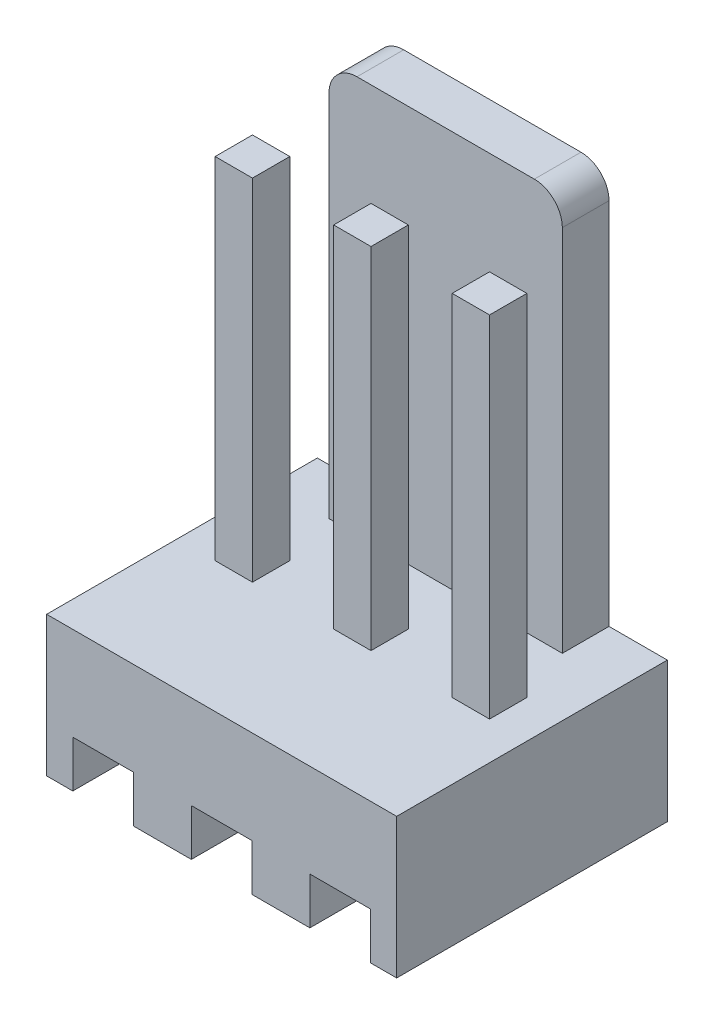
ISO-10303-21;
HEADER;
FILE_DESCRIPTION(('STEP AP214'),'2;1');
FILE_NAME('part.step','',(''),(''),'','','');
FILE_SCHEMA(('AUTOMOTIVE_DESIGN { 1 0 10303 214 1 1 1 1 }'));
ENDSEC;
DATA;
#1=APPLICATION_CONTEXT('core data for automotive mechanical design processes');
#2=APPLICATION_PROTOCOL_DEFINITION('international standard','automotive_design',2000,#1);
#3=PRODUCT_CONTEXT('',#1,'mechanical');
#4=PRODUCT('Part','Part','',(#3));
#5=PRODUCT_RELATED_PRODUCT_CATEGORY('part','',(#4));
#6=PRODUCT_DEFINITION_FORMATION('','',#4);
#7=PRODUCT_DEFINITION_CONTEXT('part definition',#1,'design');
#8=PRODUCT_DEFINITION('design','',#6,#7);
#9=PRODUCT_DEFINITION_SHAPE('','',#8);
#10=(LENGTH_UNIT() NAMED_UNIT(*) SI_UNIT(.MILLI.,.METRE.));
#11=(NAMED_UNIT(*) PLANE_ANGLE_UNIT() SI_UNIT($,.RADIAN.));
#12=(NAMED_UNIT(*) SI_UNIT($,.STERADIAN.) SOLID_ANGLE_UNIT());
#13=UNCERTAINTY_MEASURE_WITH_UNIT(LENGTH_MEASURE(1.E-05),#10,'distance_accuracy_value','');
#14=(GEOMETRIC_REPRESENTATION_CONTEXT(3) GLOBAL_UNCERTAINTY_ASSIGNED_CONTEXT((#13)) GLOBAL_UNIT_ASSIGNED_CONTEXT((#10,
#11,#12)) REPRESENTATION_CONTEXT('',''));
#15=CARTESIAN_POINT('',(0.,0.,0.));
#16=DIRECTION('',(0.,0.,1.));
#17=DIRECTION('',(1.,0.,0.));
#18=AXIS2_PLACEMENT_3D('',#15,#16,#17);
#19=CARTESIAN_POINT('',(5.89,10.5,-3.6));
#20=DIRECTION('',(1.,0.,0.));
#21=DIRECTION('',(0.,0.,-1.));
#22=AXIS2_PLACEMENT_3D('',#19,#20,#21);
#23=PLANE('',#22);
#24=DIRECTION('',(0.,0.,1.));
#25=VECTOR('',#24,1.);
#26=CARTESIAN_POINT('',(5.89,3.,-3.6));
#27=LINE('',#26,#25);
#28=CARTESIAN_POINT('',(5.89,3.,-3.6));
#29=VERTEX_POINT('',#28);
#30=CARTESIAN_POINT('',(5.89,3.,-2.8));
#31=VERTEX_POINT('',#30);
#32=EDGE_CURVE('E111',#29,#31,#27,.T.);
#33=ORIENTED_EDGE('',*,*,#32,.T.);
#34=DIRECTION('',(0.,-1.,0.));
#35=VECTOR('',#34,1.);
#36=CARTESIAN_POINT('',(5.89,10.5,-2.8));
#37=LINE('',#36,#35);
#38=CARTESIAN_POINT('',(5.89,10.5,-2.8));
#39=VERTEX_POINT('',#38);
#40=EDGE_CURVE('E12',#39,#31,#37,.T.);
#41=ORIENTED_EDGE('',*,*,#40,.F.);
#42=DIRECTION('',(0.,0.,1.));
#43=VECTOR('',#42,1.);
#44=CARTESIAN_POINT('',(5.89,10.5,-3.6));
#45=LINE('',#44,#43);
#46=CARTESIAN_POINT('',(5.89,10.5,-3.6));
#47=VERTEX_POINT('',#46);
#48=EDGE_CURVE('E99',#47,#39,#45,.T.);
#49=ORIENTED_EDGE('',*,*,#48,.F.);
#50=DIRECTION('',(0.,-1.,0.));
#51=VECTOR('',#50,1.);
#52=CARTESIAN_POINT('',(5.89,10.5,-3.6));
#53=LINE('',#52,#51);
#54=EDGE_CURVE('E107',#47,#29,#53,.T.);
#55=ORIENTED_EDGE('',*,*,#54,.T.);
#56=EDGE_LOOP('',(#33,#41,#49,#55));
#57=FACE_BOUND('',#56,.T.);
#58=ADVANCED_FACE('F48',(#57),#23,.F.);
#59=CARTESIAN_POINT('',(5.89,10.5,-2.8));
#60=DIRECTION('',(0.,0.,-1.));
#61=DIRECTION('',(-1.,0.,0.));
#62=AXIS2_PLACEMENT_3D('',#59,#60,#61);
#63=PLANE('',#62);
#64=DIRECTION('',(1.,0.,0.));
#65=VECTOR('',#64,1.);
#66=CARTESIAN_POINT('',(5.89,3.,-2.8));
#67=LINE('',#66,#65);
#68=CARTESIAN_POINT('',(6.69,3.,-2.8));
#69=VERTEX_POINT('',#68);
#70=EDGE_CURVE('E103',#31,#69,#67,.T.);
#71=ORIENTED_EDGE('',*,*,#70,.T.);
#72=DIRECTION('',(0.,-1.,0.));
#73=VECTOR('',#72,1.);
#74=CARTESIAN_POINT('',(6.69,10.5,-2.8));
#75=LINE('',#74,#73);
#76=CARTESIAN_POINT('',(6.69,10.5,-2.8));
#77=VERTEX_POINT('',#76);
#78=EDGE_CURVE('E56',#77,#69,#75,.T.);
#79=ORIENTED_EDGE('',*,*,#78,.F.);
#80=DIRECTION('',(1.,0.,0.));
#81=VECTOR('',#80,1.);
#82=CARTESIAN_POINT('',(5.89,10.5,-2.8));
#83=LINE('',#82,#81);
#84=EDGE_CURVE('E94',#39,#77,#83,.T.);
#85=ORIENTED_EDGE('',*,*,#84,.F.);
#86=ORIENTED_EDGE('',*,*,#40,.T.);
#87=EDGE_LOOP('',(#71,#79,#85,#86));
#88=FACE_BOUND('',#87,.T.);
#89=ADVANCED_FACE('F102',(#88),#63,.F.);
#90=CARTESIAN_POINT('',(6.69,10.5,-3.6));
#91=DIRECTION('',(-1.,0.,0.));
#92=DIRECTION('',(0.,0.,1.));
#93=AXIS2_PLACEMENT_3D('',#90,#91,#92);
#94=PLANE('',#93);
#95=DIRECTION('',(0.,0.,-1.));
#96=VECTOR('',#95,1.);
#97=CARTESIAN_POINT('',(6.69,3.,-3.6));
#98=LINE('',#97,#96);
#99=CARTESIAN_POINT('',(6.69,3.,-3.6));
#100=VERTEX_POINT('',#99);
#101=EDGE_CURVE('E81',#69,#100,#98,.T.);
#102=ORIENTED_EDGE('',*,*,#101,.T.);
#103=DIRECTION('',(0.,-1.,0.));
#104=VECTOR('',#103,1.);
#105=CARTESIAN_POINT('',(6.69,10.5,-3.6));
#106=LINE('',#105,#104);
#107=CARTESIAN_POINT('',(6.69,10.5,-3.6));
#108=VERTEX_POINT('',#107);
#109=EDGE_CURVE('E104',#108,#100,#106,.T.);
#110=ORIENTED_EDGE('',*,*,#109,.F.);
#111=DIRECTION('',(0.,0.,-1.));
#112=VECTOR('',#111,1.);
#113=CARTESIAN_POINT('',(6.69,10.5,-3.6));
#114=LINE('',#113,#112);
#115=EDGE_CURVE('E97',#77,#108,#114,.T.);
#116=ORIENTED_EDGE('',*,*,#115,.F.);
#117=ORIENTED_EDGE('',*,*,#78,.T.);
#118=EDGE_LOOP('',(#102,#110,#116,#117));
#119=FACE_BOUND('',#118,.T.);
#120=ADVANCED_FACE('F105',(#119),#94,.F.);
#121=CARTESIAN_POINT('',(5.89,10.5,-3.6));
#122=DIRECTION('',(0.,0.,1.));
#123=DIRECTION('',(1.,0.,0.));
#124=AXIS2_PLACEMENT_3D('',#121,#122,#123);
#125=PLANE('',#124);
#126=DIRECTION('',(-1.,0.,0.));
#127=VECTOR('',#126,1.);
#128=CARTESIAN_POINT('',(5.89,3.,-3.6));
#129=LINE('',#128,#127);
#130=EDGE_CURVE('E87',#100,#29,#129,.T.);
#131=ORIENTED_EDGE('',*,*,#130,.T.);
#132=ORIENTED_EDGE('',*,*,#54,.F.);
#133=DIRECTION('',(-1.,0.,0.));
#134=VECTOR('',#133,1.);
#135=CARTESIAN_POINT('',(5.89,10.5,-3.6));
#136=LINE('',#135,#134);
#137=EDGE_CURVE('E64',#108,#47,#136,.T.);
#138=ORIENTED_EDGE('',*,*,#137,.F.);
#139=ORIENTED_EDGE('',*,*,#109,.T.);
#140=EDGE_LOOP('',(#131,#132,#138,#139));
#141=FACE_BOUND('',#140,.T.);
#142=ADVANCED_FACE('F118',(#141),#125,.F.);
#143=CARTESIAN_POINT('',(5.89,10.5,-2.8));
#144=DIRECTION('',(0.,1.,0.));
#145=DIRECTION('',(0.,0.,1.));
#146=AXIS2_PLACEMENT_3D('',#143,#144,#145);
#147=PLANE('',#146);
#148=ORIENTED_EDGE('',*,*,#48,.T.);
#149=ORIENTED_EDGE('',*,*,#84,.T.);
#150=ORIENTED_EDGE('',*,*,#115,.T.);
#151=ORIENTED_EDGE('',*,*,#137,.T.);
#152=EDGE_LOOP('',(#148,#149,#150,#151));
#153=FACE_BOUND('',#152,.T.);
#154=ADVANCED_FACE('F95',(#153),#147,.T.);
#155=CARTESIAN_POINT('',(5.89,3.,-2.8));
#156=DIRECTION('',(0.,1.,0.));
#157=DIRECTION('',(0.,0.,1.));
#158=AXIS2_PLACEMENT_3D('',#155,#156,#157);
#159=PLANE('',#158);
#160=ORIENTED_EDGE('',*,*,#32,.F.);
#161=ORIENTED_EDGE('',*,*,#130,.F.);
#162=ORIENTED_EDGE('',*,*,#101,.F.);
#163=ORIENTED_EDGE('',*,*,#70,.F.);
#164=EDGE_LOOP('',(#160,#161,#162,#163));
#165=FACE_BOUND('',#164,.T.);
#166=ADVANCED_FACE('F121',(#165),#159,.F.);
#167=CLOSED_SHELL('',(#58,#89,#120,#142,#154,#166));
#168=MANIFOLD_SOLID_BREP('B2',#167);
#169=CARTESIAN_POINT('',(1.61,10.5,-3.6));
#170=DIRECTION('',(0.,0.,1.));
#171=DIRECTION('',(1.,0.,0.));
#172=AXIS2_PLACEMENT_3D('',#169,#170,#171);
#173=PLANE('',#172);
#174=DIRECTION('',(-1.,0.,0.));
#175=VECTOR('',#174,1.);
#176=CARTESIAN_POINT('',(1.61,3.,-3.6));
#177=LINE('',#176,#175);
#178=CARTESIAN_POINT('',(1.61,3.,-3.6));
#179=VERTEX_POINT('',#178);
#180=CARTESIAN_POINT('',(0.810000000000001,3.,-3.6));
#181=VERTEX_POINT('',#180);
#182=EDGE_CURVE('E245',#179,#181,#177,.T.);
#183=ORIENTED_EDGE('',*,*,#182,.T.);
#184=DIRECTION('',(0.,-1.,0.));
#185=VECTOR('',#184,1.);
#186=CARTESIAN_POINT('',(0.810000000000001,10.5,-3.6));
#187=LINE('',#186,#185);
#188=CARTESIAN_POINT('',(0.810000000000001,10.5,-3.6));
#189=VERTEX_POINT('',#188);
#190=EDGE_CURVE('E46',#189,#181,#187,.T.);
#191=ORIENTED_EDGE('',*,*,#190,.F.);
#192=DIRECTION('',(-1.,0.,0.));
#193=VECTOR('',#192,1.);
#194=CARTESIAN_POINT('',(1.61,10.5,-3.6));
#195=LINE('',#194,#193);
#196=CARTESIAN_POINT('',(1.61,10.5,-3.6));
#197=VERTEX_POINT('',#196);
#198=EDGE_CURVE('E233',#197,#189,#195,.T.);
#199=ORIENTED_EDGE('',*,*,#198,.F.);
#200=DIRECTION('',(0.,-1.,0.));
#201=VECTOR('',#200,1.);
#202=CARTESIAN_POINT('',(1.61,10.5,-3.6));
#203=LINE('',#202,#201);
#204=EDGE_CURVE('E241',#197,#179,#203,.T.);
#205=ORIENTED_EDGE('',*,*,#204,.T.);
#206=EDGE_LOOP('',(#183,#191,#199,#205));
#207=FACE_BOUND('',#206,.T.);
#208=ADVANCED_FACE('F182',(#207),#173,.F.);
#209=CARTESIAN_POINT('',(0.810000000000001,10.5,-3.6));
#210=DIRECTION('',(1.,0.,0.));
#211=DIRECTION('',(0.,0.,-1.));
#212=AXIS2_PLACEMENT_3D('',#209,#210,#211);
#213=PLANE('',#212);
#214=DIRECTION('',(0.,0.,1.));
#215=VECTOR('',#214,1.);
#216=CARTESIAN_POINT('',(0.810000000000001,3.,-3.6));
#217=LINE('',#216,#215);
#218=CARTESIAN_POINT('',(0.810000000000001,3.,-2.8));
#219=VERTEX_POINT('',#218);
#220=EDGE_CURVE('E237',#181,#219,#217,.T.);
#221=ORIENTED_EDGE('',*,*,#220,.T.);
#222=DIRECTION('',(0.,-1.,0.));
#223=VECTOR('',#222,1.);
#224=CARTESIAN_POINT('',(0.810000000000001,10.5,-2.8));
#225=LINE('',#224,#223);
#226=CARTESIAN_POINT('',(0.810000000000001,10.5,-2.8));
#227=VERTEX_POINT('',#226);
#228=EDGE_CURVE('E190',#227,#219,#225,.T.);
#229=ORIENTED_EDGE('',*,*,#228,.F.);
#230=DIRECTION('',(0.,0.,1.));
#231=VECTOR('',#230,1.);
#232=CARTESIAN_POINT('',(0.810000000000001,10.5,-3.6));
#233=LINE('',#232,#231);
#234=EDGE_CURVE('E228',#189,#227,#233,.T.);
#235=ORIENTED_EDGE('',*,*,#234,.F.);
#236=ORIENTED_EDGE('',*,*,#190,.T.);
#237=EDGE_LOOP('',(#221,#229,#235,#236));
#238=FACE_BOUND('',#237,.T.);
#239=ADVANCED_FACE('F236',(#238),#213,.F.);
#240=CARTESIAN_POINT('',(1.61,10.5,-2.8));
#241=DIRECTION('',(0.,0.,-1.));
#242=DIRECTION('',(-1.,0.,0.));
#243=AXIS2_PLACEMENT_3D('',#240,#241,#242);
#244=PLANE('',#243);
#245=DIRECTION('',(1.,0.,0.));
#246=VECTOR('',#245,1.);
#247=CARTESIAN_POINT('',(1.61,3.,-2.8));
#248=LINE('',#247,#246);
#249=CARTESIAN_POINT('',(1.61,3.,-2.8));
#250=VERTEX_POINT('',#249);
#251=EDGE_CURVE('E215',#219,#250,#248,.T.);
#252=ORIENTED_EDGE('',*,*,#251,.T.);
#253=DIRECTION('',(0.,-1.,0.));
#254=VECTOR('',#253,1.);
#255=CARTESIAN_POINT('',(1.61,10.5,-2.8));
#256=LINE('',#255,#254);
#257=CARTESIAN_POINT('',(1.61,10.5,-2.8));
#258=VERTEX_POINT('',#257);
#259=EDGE_CURVE('E238',#258,#250,#256,.T.);
#260=ORIENTED_EDGE('',*,*,#259,.F.);
#261=DIRECTION('',(1.,0.,0.));
#262=VECTOR('',#261,1.);
#263=CARTESIAN_POINT('',(1.61,10.5,-2.8));
#264=LINE('',#263,#262);
#265=EDGE_CURVE('E231',#227,#258,#264,.T.);
#266=ORIENTED_EDGE('',*,*,#265,.F.);
#267=ORIENTED_EDGE('',*,*,#228,.T.);
#268=EDGE_LOOP('',(#252,#260,#266,#267));
#269=FACE_BOUND('',#268,.T.);
#270=ADVANCED_FACE('F239',(#269),#244,.F.);
#271=CARTESIAN_POINT('',(1.61,10.5,-3.6));
#272=DIRECTION('',(-1.,0.,0.));
#273=DIRECTION('',(0.,0.,1.));
#274=AXIS2_PLACEMENT_3D('',#271,#272,#273);
#275=PLANE('',#274);
#276=DIRECTION('',(0.,0.,-1.));
#277=VECTOR('',#276,1.);
#278=CARTESIAN_POINT('',(1.61,3.,-3.6));
#279=LINE('',#278,#277);
#280=EDGE_CURVE('E221',#250,#179,#279,.T.);
#281=ORIENTED_EDGE('',*,*,#280,.T.);
#282=ORIENTED_EDGE('',*,*,#204,.F.);
#283=DIRECTION('',(0.,0.,-1.));
#284=VECTOR('',#283,1.);
#285=CARTESIAN_POINT('',(1.61,10.5,-3.6));
#286=LINE('',#285,#284);
#287=EDGE_CURVE('E198',#258,#197,#286,.T.);
#288=ORIENTED_EDGE('',*,*,#287,.F.);
#289=ORIENTED_EDGE('',*,*,#259,.T.);
#290=EDGE_LOOP('',(#281,#282,#288,#289));
#291=FACE_BOUND('',#290,.T.);
#292=ADVANCED_FACE('F252',(#291),#275,.F.);
#293=CARTESIAN_POINT('',(0.810000000000001,10.5,-3.6));
#294=DIRECTION('',(0.,1.,0.));
#295=DIRECTION('',(0.,0.,1.));
#296=AXIS2_PLACEMENT_3D('',#293,#294,#295);
#297=PLANE('',#296);
#298=ORIENTED_EDGE('',*,*,#198,.T.);
#299=ORIENTED_EDGE('',*,*,#234,.T.);
#300=ORIENTED_EDGE('',*,*,#265,.T.);
#301=ORIENTED_EDGE('',*,*,#287,.T.);
#302=EDGE_LOOP('',(#298,#299,#300,#301));
#303=FACE_BOUND('',#302,.T.);
#304=ADVANCED_FACE('F229',(#303),#297,.T.);
#305=CARTESIAN_POINT('',(0.810000000000001,3.,-3.6));
#306=DIRECTION('',(0.,1.,0.));
#307=DIRECTION('',(0.,0.,1.));
#308=AXIS2_PLACEMENT_3D('',#305,#306,#307);
#309=PLANE('',#308);
#310=ORIENTED_EDGE('',*,*,#182,.F.);
#311=ORIENTED_EDGE('',*,*,#280,.F.);
#312=ORIENTED_EDGE('',*,*,#251,.F.);
#313=ORIENTED_EDGE('',*,*,#220,.F.);
#314=EDGE_LOOP('',(#310,#311,#312,#313));
#315=FACE_BOUND('',#314,.T.);
#316=ADVANCED_FACE('F255',(#315),#309,.F.);
#317=CLOSED_SHELL('',(#208,#239,#270,#292,#304,#316));
#318=MANIFOLD_SOLID_BREP('B6',#317);
#319=CARTESIAN_POINT('',(3.35,10.5,-3.6));
#320=DIRECTION('',(1.,0.,0.));
#321=DIRECTION('',(0.,0.,-1.));
#322=AXIS2_PLACEMENT_3D('',#319,#320,#321);
#323=PLANE('',#322);
#324=DIRECTION('',(0.,0.,1.));
#325=VECTOR('',#324,1.);
#326=CARTESIAN_POINT('',(3.35,3.,-3.6));
#327=LINE('',#326,#325);
#328=CARTESIAN_POINT('',(3.35,3.,-3.6));
#329=VERTEX_POINT('',#328);
#330=CARTESIAN_POINT('',(3.35,3.,-2.8));
#331=VERTEX_POINT('',#330);
#332=EDGE_CURVE('E378',#329,#331,#327,.T.);
#333=ORIENTED_EDGE('',*,*,#332,.T.);
#334=DIRECTION('',(0.,-1.,0.));
#335=VECTOR('',#334,1.);
#336=CARTESIAN_POINT('',(3.35,10.5,-2.8));
#337=LINE('',#336,#335);
#338=CARTESIAN_POINT('',(3.35,10.5,-2.8));
#339=VERTEX_POINT('',#338);
#340=EDGE_CURVE('E180',#339,#331,#337,.T.);
#341=ORIENTED_EDGE('',*,*,#340,.F.);
#342=DIRECTION('',(0.,0.,1.));
#343=VECTOR('',#342,1.);
#344=CARTESIAN_POINT('',(3.35,10.5,-3.6));
#345=LINE('',#344,#343);
#346=CARTESIAN_POINT('',(3.35,10.5,-3.6));
#347=VERTEX_POINT('',#346);
#348=EDGE_CURVE('E366',#347,#339,#345,.T.);
#349=ORIENTED_EDGE('',*,*,#348,.F.);
#350=DIRECTION('',(0.,-1.,0.));
#351=VECTOR('',#350,1.);
#352=CARTESIAN_POINT('',(3.35,10.5,-3.6));
#353=LINE('',#352,#351);
#354=EDGE_CURVE('E374',#347,#329,#353,.T.);
#355=ORIENTED_EDGE('',*,*,#354,.T.);
#356=EDGE_LOOP('',(#333,#341,#349,#355));
#357=FACE_BOUND('',#356,.T.);
#358=ADVANCED_FACE('F315',(#357),#323,.F.);
#359=CARTESIAN_POINT('',(3.35,10.5,-2.8));
#360=DIRECTION('',(0.,0.,-1.));
#361=DIRECTION('',(-1.,0.,0.));
#362=AXIS2_PLACEMENT_3D('',#359,#360,#361);
#363=PLANE('',#362);
#364=DIRECTION('',(1.,0.,0.));
#365=VECTOR('',#364,1.);
#366=CARTESIAN_POINT('',(3.35,3.,-2.8));
#367=LINE('',#366,#365);
#368=CARTESIAN_POINT('',(4.15,3.,-2.8));
#369=VERTEX_POINT('',#368);
#370=EDGE_CURVE('E370',#331,#369,#367,.T.);
#371=ORIENTED_EDGE('',*,*,#370,.T.);
#372=DIRECTION('',(0.,-1.,0.));
#373=VECTOR('',#372,1.);
#374=CARTESIAN_POINT('',(4.15,10.5,-2.8));
#375=LINE('',#374,#373);
#376=CARTESIAN_POINT('',(4.15,10.5,-2.8));
#377=VERTEX_POINT('',#376);
#378=EDGE_CURVE('E323',#377,#369,#375,.T.);
#379=ORIENTED_EDGE('',*,*,#378,.F.);
#380=DIRECTION('',(1.,0.,0.));
#381=VECTOR('',#380,1.);
#382=CARTESIAN_POINT('',(3.35,10.5,-2.8));
#383=LINE('',#382,#381);
#384=EDGE_CURVE('E361',#339,#377,#383,.T.);
#385=ORIENTED_EDGE('',*,*,#384,.F.);
#386=ORIENTED_EDGE('',*,*,#340,.T.);
#387=EDGE_LOOP('',(#371,#379,#385,#386));
#388=FACE_BOUND('',#387,.T.);
#389=ADVANCED_FACE('F369',(#388),#363,.F.);
#390=CARTESIAN_POINT('',(4.15,10.5,-3.6));
#391=DIRECTION('',(-1.,0.,0.));
#392=DIRECTION('',(0.,0.,1.));
#393=AXIS2_PLACEMENT_3D('',#390,#391,#392);
#394=PLANE('',#393);
#395=DIRECTION('',(0.,0.,-1.));
#396=VECTOR('',#395,1.);
#397=CARTESIAN_POINT('',(4.15,3.,-3.6));
#398=LINE('',#397,#396);
#399=CARTESIAN_POINT('',(4.15,3.,-3.6));
#400=VERTEX_POINT('',#399);
#401=EDGE_CURVE('E348',#369,#400,#398,.T.);
#402=ORIENTED_EDGE('',*,*,#401,.T.);
#403=DIRECTION('',(0.,-1.,0.));
#404=VECTOR('',#403,1.);
#405=CARTESIAN_POINT('',(4.15,10.5,-3.6));
#406=LINE('',#405,#404);
#407=CARTESIAN_POINT('',(4.15,10.5,-3.6));
#408=VERTEX_POINT('',#407);
#409=EDGE_CURVE('E371',#408,#400,#406,.T.);
#410=ORIENTED_EDGE('',*,*,#409,.F.);
#411=DIRECTION('',(0.,0.,-1.));
#412=VECTOR('',#411,1.);
#413=CARTESIAN_POINT('',(4.15,10.5,-3.6));
#414=LINE('',#413,#412);
#415=EDGE_CURVE('E364',#377,#408,#414,.T.);
#416=ORIENTED_EDGE('',*,*,#415,.F.);
#417=ORIENTED_EDGE('',*,*,#378,.T.);
#418=EDGE_LOOP('',(#402,#410,#416,#417));
#419=FACE_BOUND('',#418,.T.);
#420=ADVANCED_FACE('F372',(#419),#394,.F.);
#421=CARTESIAN_POINT('',(3.35,10.5,-3.6));
#422=DIRECTION('',(0.,0.,1.));
#423=DIRECTION('',(1.,0.,0.));
#424=AXIS2_PLACEMENT_3D('',#421,#422,#423);
#425=PLANE('',#424);
#426=DIRECTION('',(-1.,0.,0.));
#427=VECTOR('',#426,1.);
#428=CARTESIAN_POINT('',(3.35,3.,-3.6));
#429=LINE('',#428,#427);
#430=EDGE_CURVE('E354',#400,#329,#429,.T.);
#431=ORIENTED_EDGE('',*,*,#430,.T.);
#432=ORIENTED_EDGE('',*,*,#354,.F.);
#433=DIRECTION('',(-1.,0.,0.));
#434=VECTOR('',#433,1.);
#435=CARTESIAN_POINT('',(3.35,10.5,-3.6));
#436=LINE('',#435,#434);
#437=EDGE_CURVE('E331',#408,#347,#436,.T.);
#438=ORIENTED_EDGE('',*,*,#437,.F.);
#439=ORIENTED_EDGE('',*,*,#409,.T.);
#440=EDGE_LOOP('',(#431,#432,#438,#439));
#441=FACE_BOUND('',#440,.T.);
#442=ADVANCED_FACE('F385',(#441),#425,.F.);
#443=CARTESIAN_POINT('',(3.35,10.5,-3.6));
#444=DIRECTION('',(0.,1.,0.));
#445=DIRECTION('',(0.,0.,1.));
#446=AXIS2_PLACEMENT_3D('',#443,#444,#445);
#447=PLANE('',#446);
#448=ORIENTED_EDGE('',*,*,#348,.T.);
#449=ORIENTED_EDGE('',*,*,#384,.T.);
#450=ORIENTED_EDGE('',*,*,#415,.T.);
#451=ORIENTED_EDGE('',*,*,#437,.T.);
#452=EDGE_LOOP('',(#448,#449,#450,#451));
#453=FACE_BOUND('',#452,.T.);
#454=ADVANCED_FACE('F362',(#453),#447,.T.);
#455=CARTESIAN_POINT('',(3.35,3.,-3.6));
#456=DIRECTION('',(0.,1.,0.));
#457=DIRECTION('',(0.,0.,1.));
#458=AXIS2_PLACEMENT_3D('',#455,#456,#457);
#459=PLANE('',#458);
#460=ORIENTED_EDGE('',*,*,#332,.F.);
#461=ORIENTED_EDGE('',*,*,#430,.F.);
#462=ORIENTED_EDGE('',*,*,#401,.F.);
#463=ORIENTED_EDGE('',*,*,#370,.F.);
#464=EDGE_LOOP('',(#460,#461,#462,#463));
#465=FACE_BOUND('',#464,.T.);
#466=ADVANCED_FACE('F388',(#465),#459,.F.);
#467=CLOSED_SHELL('',(#358,#389,#420,#442,#454,#466));
#468=MANIFOLD_SOLID_BREP('B40',#467);
#469=CARTESIAN_POINT('',(0.,0.,-5.8));
#470=DIRECTION('',(0.,-1.,0.));
#471=DIRECTION('',(0.,0.,-1.));
#472=AXIS2_PLACEMENT_3D('',#469,#470,#471);
#473=PLANE('',#472);
#474=DIRECTION('',(0.,0.,1.));
#475=VECTOR('',#474,1.);
#476=CARTESIAN_POINT('',(1.86,0.,-5.8));
#477=LINE('',#476,#475);
#478=CARTESIAN_POINT('',(1.86,0.,-5.8));
#479=VERTEX_POINT('',#478);
#480=CARTESIAN_POINT('',(1.86,0.,0.));
#481=VERTEX_POINT('',#480);
#482=EDGE_CURVE('E615',#479,#481,#477,.T.);
#483=ORIENTED_EDGE('',*,*,#482,.F.);
#484=DIRECTION('',(-1.,0.,0.));
#485=VECTOR('',#484,1.);
#486=CARTESIAN_POINT('',(0.,0.,-5.8));
#487=LINE('',#486,#485);
#488=CARTESIAN_POINT('',(3.1,0.,-5.8));
#489=VERTEX_POINT('',#488);
#490=EDGE_CURVE('E699',#489,#479,#487,.T.);
#491=ORIENTED_EDGE('',*,*,#490,.F.);
#492=DIRECTION('',(0.,0.,-1.));
#493=VECTOR('',#492,1.);
#494=CARTESIAN_POINT('',(3.1,0.,-5.8));
#495=LINE('',#494,#493);
#496=CARTESIAN_POINT('',(3.1,0.,0.));
#497=VERTEX_POINT('',#496);
#498=EDGE_CURVE('E735',#497,#489,#495,.T.);
#499=ORIENTED_EDGE('',*,*,#498,.F.);
#500=DIRECTION('',(1.,0.,0.));
#501=VECTOR('',#500,1.);
#502=CARTESIAN_POINT('',(0.,0.,0.));
#503=LINE('',#502,#501);
#504=EDGE_CURVE('E691',#481,#497,#503,.T.);
#505=ORIENTED_EDGE('',*,*,#504,.F.);
#506=EDGE_LOOP('',(#483,#491,#499,#505));
#507=FACE_BOUND('',#506,.T.);
#508=ADVANCED_FACE('F439',(#507),#473,.T.);
#509=DIRECTION('',(0.,0.,-1.));
#510=VECTOR('',#509,1.);
#511=CARTESIAN_POINT('',(5.64,0.,-5.8));
#512=LINE('',#511,#510);
#513=CARTESIAN_POINT('',(5.64,0.,0.));
#514=VERTEX_POINT('',#513);
#515=CARTESIAN_POINT('',(5.64,0.,-5.8));
#516=VERTEX_POINT('',#515);
#517=EDGE_CURVE('E742',#514,#516,#512,.T.);
#518=ORIENTED_EDGE('',*,*,#517,.F.);
#519=CARTESIAN_POINT('',(4.4,0.,0.));
#520=VERTEX_POINT('',#519);
#521=EDGE_CURVE('E692',#520,#514,#503,.T.);
#522=ORIENTED_EDGE('',*,*,#521,.F.);
#523=DIRECTION('',(0.,0.,1.));
#524=VECTOR('',#523,1.);
#525=CARTESIAN_POINT('',(4.4,0.,-5.8));
#526=LINE('',#525,#524);
#527=CARTESIAN_POINT('',(4.4,0.,-5.8));
#528=VERTEX_POINT('',#527);
#529=EDGE_CURVE('E733',#528,#520,#526,.T.);
#530=ORIENTED_EDGE('',*,*,#529,.F.);
#531=EDGE_CURVE('E698',#516,#528,#487,.T.);
#532=ORIENTED_EDGE('',*,*,#531,.F.);
#533=EDGE_LOOP('',(#518,#522,#530,#532));
#534=FACE_BOUND('',#533,.T.);
#535=ADVANCED_FACE('F808',(#534),#473,.T.);
#536=DIRECTION('',(0.,0.,-1.));
#537=VECTOR('',#536,1.);
#538=CARTESIAN_POINT('',(0.559999999999999,0.,-5.8));
#539=LINE('',#538,#537);
#540=CARTESIAN_POINT('',(0.559999999999999,0.,0.));
#541=VERTEX_POINT('',#540);
#542=CARTESIAN_POINT('',(0.559999999999999,0.,-5.8));
#543=VERTEX_POINT('',#542);
#544=EDGE_CURVE('E454',#541,#543,#539,.T.);
#545=ORIENTED_EDGE('',*,*,#544,.F.);
#546=CARTESIAN_POINT('',(0.,0.,0.));
#547=VERTEX_POINT('',#546);
#548=EDGE_CURVE('E609',#547,#541,#503,.T.);
#549=ORIENTED_EDGE('',*,*,#548,.F.);
#550=DIRECTION('',(0.,0.,1.));
#551=VECTOR('',#550,1.);
#552=CARTESIAN_POINT('',(0.,0.,0.));
#553=LINE('',#552,#551);
#554=CARTESIAN_POINT('',(0.,0.,-5.8));
#555=VERTEX_POINT('',#554);
#556=EDGE_CURVE('E680',#555,#547,#553,.T.);
#557=ORIENTED_EDGE('',*,*,#556,.F.);
#558=EDGE_CURVE('E695',#543,#555,#487,.T.);
#559=ORIENTED_EDGE('',*,*,#558,.F.);
#560=EDGE_LOOP('',(#545,#549,#557,#559));
#561=FACE_BOUND('',#560,.T.);
#562=ADVANCED_FACE('F797',(#561),#473,.T.);
#563=CARTESIAN_POINT('',(0.,11.5,0.));
#564=DIRECTION('',(1.,0.,0.));
#565=DIRECTION('',(0.,0.,-1.));
#566=AXIS2_PLACEMENT_3D('',#563,#564,#565);
#567=PLANE('',#566);
#568=DIRECTION('',(0.,0.,-1.));
#569=VECTOR('',#568,1.);
#570=CARTESIAN_POINT('',(0.,3.,0.));
#571=LINE('',#570,#569);
#572=CARTESIAN_POINT('',(0.,3.,0.));
#573=VERTEX_POINT('',#572);
#574=CARTESIAN_POINT('',(0.,3.,-5.8));
#575=VERTEX_POINT('',#574);
#576=EDGE_CURVE('E678',#573,#575,#571,.T.);
#577=ORIENTED_EDGE('',*,*,#576,.T.);
#578=DIRECTION('',(0.,-1.,0.));
#579=VECTOR('',#578,1.);
#580=CARTESIAN_POINT('',(0.,11.5,-5.8));
#581=LINE('',#580,#579);
#582=EDGE_CURVE('E684',#575,#555,#581,.T.);
#583=ORIENTED_EDGE('',*,*,#582,.T.);
#584=ORIENTED_EDGE('',*,*,#556,.T.);
#585=DIRECTION('',(0.,-1.,0.));
#586=VECTOR('',#585,1.);
#587=CARTESIAN_POINT('',(0.,11.5,0.));
#588=LINE('',#587,#586);
#589=EDGE_CURVE('E707',#573,#547,#588,.T.);
#590=ORIENTED_EDGE('',*,*,#589,.F.);
#591=EDGE_LOOP('',(#577,#583,#584,#590));
#592=FACE_BOUND('',#591,.T.);
#593=ADVANCED_FACE('F794',(#592),#567,.F.);
#594=CARTESIAN_POINT('',(0.,11.5,0.));
#595=DIRECTION('',(0.,0.,-1.));
#596=DIRECTION('',(-1.,0.,0.));
#597=AXIS2_PLACEMENT_3D('',#594,#595,#596);
#598=PLANE('',#597);
#599=DIRECTION('',(-1.,0.,0.));
#600=VECTOR('',#599,1.);
#601=CARTESIAN_POINT('',(1.86,1.,0.));
#602=LINE('',#601,#600);
#603=CARTESIAN_POINT('',(1.86,1.,0.));
#604=VERTEX_POINT('',#603);
#605=CARTESIAN_POINT('',(0.559999999999999,1.,0.));
#606=VERTEX_POINT('',#605);
#607=EDGE_CURVE('E599',#604,#606,#602,.T.);
#608=ORIENTED_EDGE('',*,*,#607,.F.);
#609=DIRECTION('',(0.,1.,0.));
#610=VECTOR('',#609,1.);
#611=CARTESIAN_POINT('',(1.86,1.,0.));
#612=LINE('',#611,#610);
#613=EDGE_CURVE('E596',#481,#604,#612,.T.);
#614=ORIENTED_EDGE('',*,*,#613,.F.);
#615=ORIENTED_EDGE('',*,*,#504,.T.);
#616=DIRECTION('',(0.,-1.,0.));
#617=VECTOR('',#616,1.);
#618=CARTESIAN_POINT('',(3.1,1.,0.));
#619=LINE('',#618,#617);
#620=CARTESIAN_POINT('',(3.1,1.,0.));
#621=VERTEX_POINT('',#620);
#622=EDGE_CURVE('E633',#621,#497,#619,.T.);
#623=ORIENTED_EDGE('',*,*,#622,.F.);
#624=DIRECTION('',(-1.,0.,0.));
#625=VECTOR('',#624,1.);
#626=CARTESIAN_POINT('',(3.1,1.,0.));
#627=LINE('',#626,#625);
#628=CARTESIAN_POINT('',(4.4,1.,0.));
#629=VERTEX_POINT('',#628);
#630=EDGE_CURVE('E639',#629,#621,#627,.T.);
#631=ORIENTED_EDGE('',*,*,#630,.F.);
#632=DIRECTION('',(0.,1.,0.));
#633=VECTOR('',#632,1.);
#634=CARTESIAN_POINT('',(4.4,1.,0.));
#635=LINE('',#634,#633);
#636=EDGE_CURVE('E636',#520,#629,#635,.T.);
#637=ORIENTED_EDGE('',*,*,#636,.F.);
#638=ORIENTED_EDGE('',*,*,#521,.T.);
#639=DIRECTION('',(0.,-1.,0.));
#640=VECTOR('',#639,1.);
#641=CARTESIAN_POINT('',(5.64,1.,0.));
#642=LINE('',#641,#640);
#643=CARTESIAN_POINT('',(5.64,1.,0.));
#644=VERTEX_POINT('',#643);
#645=EDGE_CURVE('E617',#644,#514,#642,.T.);
#646=ORIENTED_EDGE('',*,*,#645,.F.);
#647=DIRECTION('',(-1.,0.,0.));
#648=VECTOR('',#647,1.);
#649=CARTESIAN_POINT('',(5.64,1.,0.));
#650=LINE('',#649,#648);
#651=CARTESIAN_POINT('',(6.94,1.,0.));
#652=VERTEX_POINT('',#651);
#653=EDGE_CURVE('E622',#652,#644,#650,.T.);
#654=ORIENTED_EDGE('',*,*,#653,.F.);
#655=DIRECTION('',(0.,1.,0.));
#656=VECTOR('',#655,1.);
#657=CARTESIAN_POINT('',(6.94,1.,0.));
#658=LINE('',#657,#656);
#659=CARTESIAN_POINT('',(6.94,0.,0.));
#660=VERTEX_POINT('',#659);
#661=EDGE_CURVE('E619',#660,#652,#658,.T.);
#662=ORIENTED_EDGE('',*,*,#661,.F.);
#663=CARTESIAN_POINT('',(7.5,0.,0.));
#664=VERTEX_POINT('',#663);
#665=EDGE_CURVE('E688',#660,#664,#503,.T.);
#666=ORIENTED_EDGE('',*,*,#665,.T.);
#667=DIRECTION('',(0.,-1.,0.));
#668=VECTOR('',#667,1.);
#669=CARTESIAN_POINT('',(7.5,11.5,0.));
#670=LINE('',#669,#668);
#671=CARTESIAN_POINT('',(7.5,3.,0.));
#672=VERTEX_POINT('',#671);
#673=EDGE_CURVE('E704',#672,#664,#670,.T.);
#674=ORIENTED_EDGE('',*,*,#673,.F.);
#675=DIRECTION('',(-1.,0.,0.));
#676=VECTOR('',#675,1.);
#677=CARTESIAN_POINT('',(0.,3.,0.));
#678=LINE('',#677,#676);
#679=EDGE_CURVE('E675',#672,#573,#678,.T.);
#680=ORIENTED_EDGE('',*,*,#679,.T.);
#681=ORIENTED_EDGE('',*,*,#589,.T.);
#682=ORIENTED_EDGE('',*,*,#548,.T.);
#683=DIRECTION('',(0.,-1.,0.));
#684=VECTOR('',#683,1.);
#685=CARTESIAN_POINT('',(0.559999999999999,1.,0.));
#686=LINE('',#685,#684);
#687=EDGE_CURVE('E591',#606,#541,#686,.T.);
#688=ORIENTED_EDGE('',*,*,#687,.F.);
#689=EDGE_LOOP('',(#608,#614,#615,#623,#631,#637,#638,#646,#654,#662,#666,#674,#680,#681,#682,#688));
#690=FACE_BOUND('',#689,.T.);
#691=ADVANCED_FACE('F607',(#690),#598,.F.);
#692=CARTESIAN_POINT('',(7.5,11.5,0.));
#693=DIRECTION('',(-1.,0.,0.));
#694=DIRECTION('',(0.,0.,1.));
#695=AXIS2_PLACEMENT_3D('',#692,#693,#694);
#696=PLANE('',#695);
#697=DIRECTION('',(0.,-1.,0.));
#698=VECTOR('',#697,1.);
#699=CARTESIAN_POINT('',(7.5,11.5,-5.8));
#700=LINE('',#699,#698);
#701=CARTESIAN_POINT('',(7.5,3.,-5.8));
#702=VERTEX_POINT('',#701);
#703=CARTESIAN_POINT('',(7.5,0.,-5.8));
#704=VERTEX_POINT('',#703);
#705=EDGE_CURVE('E702',#702,#704,#700,.T.);
#706=ORIENTED_EDGE('',*,*,#705,.F.);
#707=DIRECTION('',(0.,0.,-1.));
#708=VECTOR('',#707,1.);
#709=CARTESIAN_POINT('',(7.5,3.,1.3379195746095));
#710=LINE('',#709,#708);
#711=EDGE_CURVE('E670',#672,#702,#710,.T.);
#712=ORIENTED_EDGE('',*,*,#711,.F.);
#713=ORIENTED_EDGE('',*,*,#673,.T.);
#714=DIRECTION('',(0.,0.,-1.));
#715=VECTOR('',#714,1.);
#716=CARTESIAN_POINT('',(7.5,0.,0.));
#717=LINE('',#716,#715);
#718=EDGE_CURVE('E690',#664,#704,#717,.T.);
#719=ORIENTED_EDGE('',*,*,#718,.T.);
#720=EDGE_LOOP('',(#706,#712,#713,#719));
#721=FACE_BOUND('',#720,.T.);
#722=ADVANCED_FACE('F769',(#721),#696,.F.);
#723=CARTESIAN_POINT('',(0.,11.5,-5.8));
#724=DIRECTION('',(0.,0.,1.));
#725=DIRECTION('',(1.,0.,0.));
#726=AXIS2_PLACEMENT_3D('',#723,#724,#725);
#727=PLANE('',#726);
#728=ORIENTED_EDGE('',*,*,#490,.T.);
#729=DIRECTION('',(0.,1.,0.));
#730=VECTOR('',#729,1.);
#731=CARTESIAN_POINT('',(1.86,11.5,-5.8));
#732=LINE('',#731,#730);
#733=CARTESIAN_POINT('',(1.86,1.,-5.8));
#734=VERTEX_POINT('',#733);
#735=EDGE_CURVE('E313',#479,#734,#732,.T.);
#736=ORIENTED_EDGE('',*,*,#735,.T.);
#737=DIRECTION('',(-1.,0.,0.));
#738=VECTOR('',#737,1.);
#739=CARTESIAN_POINT('',(0.,1.,-5.8));
#740=LINE('',#739,#738);
#741=CARTESIAN_POINT('',(0.559999999999999,1.,-5.8));
#742=VERTEX_POINT('',#741);
#743=EDGE_CURVE('E447',#734,#742,#740,.T.);
#744=ORIENTED_EDGE('',*,*,#743,.T.);
#745=DIRECTION('',(0.,-1.,0.));
#746=VECTOR('',#745,1.);
#747=CARTESIAN_POINT('',(0.559999999999999,11.5,-5.8));
#748=LINE('',#747,#746);
#749=EDGE_CURVE('E592',#742,#543,#748,.T.);
#750=ORIENTED_EDGE('',*,*,#749,.T.);
#751=ORIENTED_EDGE('',*,*,#558,.T.);
#752=ORIENTED_EDGE('',*,*,#582,.F.);
#753=DIRECTION('',(1.,0.,0.));
#754=VECTOR('',#753,1.);
#755=CARTESIAN_POINT('',(0.,3.,-5.8));
#756=LINE('',#755,#754);
#757=CARTESIAN_POINT('',(1.25,3.,-5.8));
#758=VERTEX_POINT('',#757);
#759=EDGE_CURVE('E664',#575,#758,#756,.T.);
#760=ORIENTED_EDGE('',*,*,#759,.T.);
#761=DIRECTION('',(0.,1.,0.));
#762=VECTOR('',#761,1.);
#763=CARTESIAN_POINT('',(1.25,11.5,-5.8));
#764=LINE('',#763,#762);
#765=CARTESIAN_POINT('',(1.25,10.9,-5.8));
#766=VERTEX_POINT('',#765);
#767=EDGE_CURVE('E667',#758,#766,#764,.T.);
#768=ORIENTED_EDGE('',*,*,#767,.T.);
#769=CARTESIAN_POINT('',(1.85,10.9,-5.8));
#770=DIRECTION('',(0.,0.,1.));
#771=DIRECTION('',(1.,0.,0.));
#772=AXIS2_PLACEMENT_3D('',#769,#770,#771);
#773=CIRCLE('',#772,0.6);
#774=CARTESIAN_POINT('',(1.85,11.5,-5.8));
#775=VERTEX_POINT('',#774);
#776=EDGE_CURVE('E729',#766,#775,#773,.F.);
#777=ORIENTED_EDGE('',*,*,#776,.T.);
#778=DIRECTION('',(-1.,0.,0.));
#779=VECTOR('',#778,1.);
#780=CARTESIAN_POINT('',(0.,11.5,-5.8));
#781=LINE('',#780,#779);
#782=CARTESIAN_POINT('',(5.65,11.5,-5.8));
#783=VERTEX_POINT('',#782);
#784=EDGE_CURVE('E681',#783,#775,#781,.T.);
#785=ORIENTED_EDGE('',*,*,#784,.F.);
#786=CARTESIAN_POINT('',(5.65,10.9,-5.8));
#787=DIRECTION('',(0.,0.,1.));
#788=DIRECTION('',(1.,0.,0.));
#789=AXIS2_PLACEMENT_3D('',#786,#787,#788);
#790=CIRCLE('',#789,0.6);
#791=CARTESIAN_POINT('',(6.25,10.9,-5.8));
#792=VERTEX_POINT('',#791);
#793=EDGE_CURVE('E727',#783,#792,#790,.F.);
#794=ORIENTED_EDGE('',*,*,#793,.T.);
#795=DIRECTION('',(0.,-1.,0.));
#796=VECTOR('',#795,1.);
#797=CARTESIAN_POINT('',(6.25,11.5,-5.8));
#798=LINE('',#797,#796);
#799=CARTESIAN_POINT('',(6.25,3.,-5.8));
#800=VERTEX_POINT('',#799);
#801=EDGE_CURVE('E657',#792,#800,#798,.T.);
#802=ORIENTED_EDGE('',*,*,#801,.T.);
#803=DIRECTION('',(1.,0.,0.));
#804=VECTOR('',#803,1.);
#805=CARTESIAN_POINT('',(0.,3.,-5.8));
#806=LINE('',#805,#804);
#807=EDGE_CURVE('E654',#800,#702,#806,.T.);
#808=ORIENTED_EDGE('',*,*,#807,.T.);
#809=ORIENTED_EDGE('',*,*,#705,.T.);
#810=CARTESIAN_POINT('',(6.94,0.,-5.8));
#811=VERTEX_POINT('',#810);
#812=EDGE_CURVE('E685',#704,#811,#487,.T.);
#813=ORIENTED_EDGE('',*,*,#812,.T.);
#814=DIRECTION('',(0.,1.,0.));
#815=VECTOR('',#814,1.);
#816=CARTESIAN_POINT('',(6.94,11.5,-5.8));
#817=LINE('',#816,#815);
#818=CARTESIAN_POINT('',(6.94,1.,-5.8));
#819=VERTEX_POINT('',#818);
#820=EDGE_CURVE('E462',#811,#819,#817,.T.);
#821=ORIENTED_EDGE('',*,*,#820,.T.);
#822=DIRECTION('',(-1.,0.,0.));
#823=VECTOR('',#822,1.);
#824=CARTESIAN_POINT('',(0.,1.,-5.8));
#825=LINE('',#824,#823);
#826=CARTESIAN_POINT('',(5.64,1.,-5.8));
#827=VERTEX_POINT('',#826);
#828=EDGE_CURVE('E744',#819,#827,#825,.T.);
#829=ORIENTED_EDGE('',*,*,#828,.T.);
#830=DIRECTION('',(0.,-1.,0.));
#831=VECTOR('',#830,1.);
#832=CARTESIAN_POINT('',(5.64,11.5,-5.8));
#833=LINE('',#832,#831);
#834=EDGE_CURVE('E630',#827,#516,#833,.T.);
#835=ORIENTED_EDGE('',*,*,#834,.T.);
#836=ORIENTED_EDGE('',*,*,#531,.T.);
#837=DIRECTION('',(0.,1.,0.));
#838=VECTOR('',#837,1.);
#839=CARTESIAN_POINT('',(4.4,11.5,-5.8));
#840=LINE('',#839,#838);
#841=CARTESIAN_POINT('',(4.4,1.,-5.8));
#842=VERTEX_POINT('',#841);
#843=EDGE_CURVE('E645',#528,#842,#840,.T.);
#844=ORIENTED_EDGE('',*,*,#843,.T.);
#845=DIRECTION('',(-1.,0.,0.));
#846=VECTOR('',#845,1.);
#847=CARTESIAN_POINT('',(0.,1.,-5.8));
#848=LINE('',#847,#846);
#849=CARTESIAN_POINT('',(3.1,1.,-5.8));
#850=VERTEX_POINT('',#849);
#851=EDGE_CURVE('E737',#842,#850,#848,.T.);
#852=ORIENTED_EDGE('',*,*,#851,.T.);
#853=DIRECTION('',(0.,-1.,0.));
#854=VECTOR('',#853,1.);
#855=CARTESIAN_POINT('',(3.1,11.5,-5.8));
#856=LINE('',#855,#854);
#857=EDGE_CURVE('E649',#850,#489,#856,.T.);
#858=ORIENTED_EDGE('',*,*,#857,.T.);
#859=EDGE_LOOP('',(#728,#736,#744,#750,#751,#752,#760,#768,#777,#785,#794,#802,#808,#809,#813,
#821,#829,#835,#836,#844,#852,#858));
#860=FACE_BOUND('',#859,.T.);
#861=ADVANCED_FACE('F749',(#860),#727,.F.);
#862=CARTESIAN_POINT('',(0.,11.5,-5.8));
#863=DIRECTION('',(0.,-1.,0.));
#864=DIRECTION('',(0.,0.,-1.));
#865=AXIS2_PLACEMENT_3D('',#862,#863,#864);
#866=PLANE('',#865);
#867=ORIENTED_EDGE('',*,*,#784,.T.);
#868=DIRECTION('',(0.,0.,1.));
#869=VECTOR('',#868,1.);
#870=CARTESIAN_POINT('',(1.85,11.5,-5.8));
#871=LINE('',#870,#869);
#872=CARTESIAN_POINT('',(1.85,11.5,-4.8));
#873=VERTEX_POINT('',#872);
#874=EDGE_CURVE('E718',#775,#873,#871,.T.);
#875=ORIENTED_EDGE('',*,*,#874,.T.);
#876=DIRECTION('',(1.,0.,0.));
#877=VECTOR('',#876,1.);
#878=CARTESIAN_POINT('',(0.,11.5,-4.8));
#879=LINE('',#878,#877);
#880=CARTESIAN_POINT('',(5.65,11.5,-4.8));
#881=VERTEX_POINT('',#880);
#882=EDGE_CURVE('E709',#873,#881,#879,.T.);
#883=ORIENTED_EDGE('',*,*,#882,.T.);
#884=DIRECTION('',(0.,0.,-1.));
#885=VECTOR('',#884,1.);
#886=CARTESIAN_POINT('',(5.65,11.5,-5.8));
#887=LINE('',#886,#885);
#888=EDGE_CURVE('E715',#881,#783,#887,.T.);
#889=ORIENTED_EDGE('',*,*,#888,.T.);
#890=EDGE_LOOP('',(#867,#875,#883,#889));
#891=FACE_BOUND('',#890,.T.);
#892=ADVANCED_FACE('F834',(#891),#866,.F.);
#893=DIRECTION('',(0.,0.,1.));
#894=VECTOR('',#893,1.);
#895=CARTESIAN_POINT('',(6.94,0.,-5.8));
#896=LINE('',#895,#894);
#897=EDGE_CURVE('E740',#811,#660,#896,.T.);
#898=ORIENTED_EDGE('',*,*,#897,.F.);
#899=ORIENTED_EDGE('',*,*,#812,.F.);
#900=ORIENTED_EDGE('',*,*,#718,.F.);
#901=ORIENTED_EDGE('',*,*,#665,.F.);
#902=EDGE_LOOP('',(#898,#899,#900,#901));
#903=FACE_BOUND('',#902,.T.);
#904=ADVANCED_FACE('F771',(#903),#473,.T.);
#905=CARTESIAN_POINT('',(-4.,3.,1.3379195746095));
#906=DIRECTION('',(0.,-1.,0.));
#907=DIRECTION('',(0.,0.,-1.));
#908=AXIS2_PLACEMENT_3D('',#905,#906,#907);
#909=PLANE('',#908);
#910=ORIENTED_EDGE('',*,*,#679,.F.);
#911=ORIENTED_EDGE('',*,*,#711,.T.);
#912=ORIENTED_EDGE('',*,*,#807,.F.);
#913=DIRECTION('',(0.,0.,1.));
#914=VECTOR('',#913,1.);
#915=CARTESIAN_POINT('',(6.25,3.,-16.3));
#916=LINE('',#915,#914);
#917=CARTESIAN_POINT('',(6.25,3.,-4.8));
#918=VERTEX_POINT('',#917);
#919=EDGE_CURVE('E652',#800,#918,#916,.T.);
#920=ORIENTED_EDGE('',*,*,#919,.T.);
#921=DIRECTION('',(1.,0.,0.));
#922=VECTOR('',#921,1.);
#923=CARTESIAN_POINT('',(-4.,3.,-4.8));
#924=LINE('',#923,#922);
#925=CARTESIAN_POINT('',(1.25,3.,-4.8));
#926=VERTEX_POINT('',#925);
#927=EDGE_CURVE('E672',#926,#918,#924,.T.);
#928=ORIENTED_EDGE('',*,*,#927,.F.);
#929=DIRECTION('',(0.,0.,1.));
#930=VECTOR('',#929,1.);
#931=CARTESIAN_POINT('',(1.25,3.,-16.3));
#932=LINE('',#931,#930);
#933=EDGE_CURVE('E662',#758,#926,#932,.T.);
#934=ORIENTED_EDGE('',*,*,#933,.F.);
#935=ORIENTED_EDGE('',*,*,#759,.F.);
#936=ORIENTED_EDGE('',*,*,#576,.F.);
#937=EDGE_LOOP('',(#910,#911,#912,#920,#928,#934,#935,#936));
#938=FACE_BOUND('',#937,.T.);
#939=ADVANCED_FACE('F776',(#938),#909,.F.);
#940=CARTESIAN_POINT('',(-4.,13.9585687382297,-4.8));
#941=DIRECTION('',(0.,0.,-1.));
#942=DIRECTION('',(0.,1.,0.));
#943=AXIS2_PLACEMENT_3D('',#940,#941,#942);
#944=PLANE('',#943);
#945=ORIENTED_EDGE('',*,*,#882,.F.);
#946=CARTESIAN_POINT('',(1.85,10.9,-4.8));
#947=DIRECTION('',(0.,0.,-1.));
#948=DIRECTION('',(0.,1.,0.));
#949=AXIS2_PLACEMENT_3D('',#946,#947,#948);
#950=CIRCLE('',#949,0.6);
#951=CARTESIAN_POINT('',(1.25,10.9,-4.8));
#952=VERTEX_POINT('',#951);
#953=EDGE_CURVE('E723',#873,#952,#950,.F.);
#954=ORIENTED_EDGE('',*,*,#953,.T.);
#955=DIRECTION('',(0.,1.,0.));
#956=VECTOR('',#955,1.);
#957=CARTESIAN_POINT('',(1.25,11.8575569587534,-4.8));
#958=LINE('',#957,#956);
#959=EDGE_CURVE('E659',#926,#952,#958,.T.);
#960=ORIENTED_EDGE('',*,*,#959,.F.);
#961=ORIENTED_EDGE('',*,*,#927,.T.);
#962=DIRECTION('',(0.,1.,0.));
#963=VECTOR('',#962,1.);
#964=CARTESIAN_POINT('',(6.25,13.9585687382298,-4.8));
#965=LINE('',#964,#963);
#966=CARTESIAN_POINT('',(6.25,10.9,-4.8));
#967=VERTEX_POINT('',#966);
#968=EDGE_CURVE('E712',#918,#967,#965,.T.);
#969=ORIENTED_EDGE('',*,*,#968,.T.);
#970=CARTESIAN_POINT('',(5.65,10.9,-4.8));
#971=DIRECTION('',(0.,0.,-1.));
#972=DIRECTION('',(0.,1.,0.));
#973=AXIS2_PLACEMENT_3D('',#970,#971,#972);
#974=CIRCLE('',#973,0.6);
#975=EDGE_CURVE('E721',#967,#881,#974,.F.);
#976=ORIENTED_EDGE('',*,*,#975,.T.);
#977=EDGE_LOOP('',(#945,#954,#960,#961,#969,#976));
#978=FACE_BOUND('',#977,.T.);
#979=ADVANCED_FACE('F786',(#978),#944,.F.);
#980=CARTESIAN_POINT('',(1.25,11.8575569587534,-16.3));
#981=DIRECTION('',(1.,0.,0.));
#982=DIRECTION('',(0.,1.,0.));
#983=AXIS2_PLACEMENT_3D('',#980,#981,#982);
#984=PLANE('',#983);
#985=ORIENTED_EDGE('',*,*,#959,.T.);
#986=DIRECTION('',(0.,0.,1.));
#987=VECTOR('',#986,1.);
#988=CARTESIAN_POINT('',(1.25,10.9,-16.3));
#989=LINE('',#988,#987);
#990=EDGE_CURVE('E725',#952,#766,#989,.F.);
#991=ORIENTED_EDGE('',*,*,#990,.T.);
#992=ORIENTED_EDGE('',*,*,#767,.F.);
#993=ORIENTED_EDGE('',*,*,#933,.T.);
#994=EDGE_LOOP('',(#985,#991,#992,#993));
#995=FACE_BOUND('',#994,.T.);
#996=ADVANCED_FACE('F859',(#995),#984,.F.);
#997=CARTESIAN_POINT('',(6.25,11.8575569587534,-16.3));
#998=DIRECTION('',(-1.,0.,0.));
#999=DIRECTION('',(0.,-1.,0.));
#1000=AXIS2_PLACEMENT_3D('',#997,#998,#999);
#1001=PLANE('',#1000);
#1002=ORIENTED_EDGE('',*,*,#801,.F.);
#1003=DIRECTION('',(0.,0.,-1.));
#1004=VECTOR('',#1003,1.);
#1005=CARTESIAN_POINT('',(6.25,10.9,-16.3));
#1006=LINE('',#1005,#1004);
#1007=EDGE_CURVE('E731',#792,#967,#1006,.F.);
#1008=ORIENTED_EDGE('',*,*,#1007,.T.);
#1009=ORIENTED_EDGE('',*,*,#968,.F.);
#1010=ORIENTED_EDGE('',*,*,#919,.F.);
#1011=EDGE_LOOP('',(#1002,#1008,#1009,#1010));
#1012=FACE_BOUND('',#1011,.T.);
#1013=ADVANCED_FACE('F780',(#1012),#1001,.F.);
#1014=CARTESIAN_POINT('',(1.85,10.9,-5.8));
#1015=DIRECTION('',(0.,0.,1.));
#1016=DIRECTION('',(1.,0.,0.));
#1017=AXIS2_PLACEMENT_3D('',#1014,#1015,#1016);
#1018=CYLINDRICAL_SURFACE('',#1017,0.6);
#1019=ORIENTED_EDGE('',*,*,#776,.F.);
#1020=ORIENTED_EDGE('',*,*,#990,.F.);
#1021=ORIENTED_EDGE('',*,*,#953,.F.);
#1022=ORIENTED_EDGE('',*,*,#874,.F.);
#1023=EDGE_LOOP('',(#1019,#1020,#1021,#1022));
#1024=FACE_BOUND('',#1023,.T.);
#1025=ADVANCED_FACE('F851',(#1024),#1018,.T.);
#1026=CARTESIAN_POINT('',(5.65,10.9,-5.8));
#1027=DIRECTION('',(0.,0.,-1.));
#1028=DIRECTION('',(-1.,0.,0.));
#1029=AXIS2_PLACEMENT_3D('',#1026,#1027,#1028);
#1030=CYLINDRICAL_SURFACE('',#1029,0.6);
#1031=ORIENTED_EDGE('',*,*,#975,.F.);
#1032=ORIENTED_EDGE('',*,*,#1007,.F.);
#1033=ORIENTED_EDGE('',*,*,#793,.F.);
#1034=ORIENTED_EDGE('',*,*,#888,.F.);
#1035=EDGE_LOOP('',(#1031,#1032,#1033,#1034));
#1036=FACE_BOUND('',#1035,.T.);
#1037=ADVANCED_FACE('F441',(#1036),#1030,.T.);
#1038=CARTESIAN_POINT('',(3.1,1.,-7.5));
#1039=DIRECTION('',(0.,1.,0.));
#1040=DIRECTION('',(-1.,0.,0.));
#1041=AXIS2_PLACEMENT_3D('',#1038,#1039,#1040);
#1042=PLANE('',#1041);
#1043=DIRECTION('',(0.,0.,1.));
#1044=VECTOR('',#1043,1.);
#1045=CARTESIAN_POINT('',(4.4,1.,-7.5));
#1046=LINE('',#1045,#1044);
#1047=EDGE_CURVE('E642',#842,#629,#1046,.T.);
#1048=ORIENTED_EDGE('',*,*,#1047,.T.);
#1049=ORIENTED_EDGE('',*,*,#630,.T.);
#1050=DIRECTION('',(0.,0.,1.));
#1051=VECTOR('',#1050,1.);
#1052=CARTESIAN_POINT('',(3.1,1.,-7.5));
#1053=LINE('',#1052,#1051);
#1054=EDGE_CURVE('E643',#850,#621,#1053,.T.);
#1055=ORIENTED_EDGE('',*,*,#1054,.F.);
#1056=ORIENTED_EDGE('',*,*,#851,.F.);
#1057=EDGE_LOOP('',(#1048,#1049,#1055,#1056));
#1058=FACE_BOUND('',#1057,.T.);
#1059=ADVANCED_FACE('F813',(#1058),#1042,.F.);
#1060=CARTESIAN_POINT('',(3.1,1.,-7.5));
#1061=DIRECTION('',(-1.,0.,0.));
#1062=DIRECTION('',(0.,0.,1.));
#1063=AXIS2_PLACEMENT_3D('',#1060,#1061,#1062);
#1064=PLANE('',#1063);
#1065=ORIENTED_EDGE('',*,*,#1054,.T.);
#1066=ORIENTED_EDGE('',*,*,#622,.T.);
#1067=ORIENTED_EDGE('',*,*,#498,.T.);
#1068=ORIENTED_EDGE('',*,*,#857,.F.);
#1069=EDGE_LOOP('',(#1065,#1066,#1067,#1068));
#1070=FACE_BOUND('',#1069,.T.);
#1071=ADVANCED_FACE('F815',(#1070),#1064,.F.);
#1072=CARTESIAN_POINT('',(4.4,1.,-7.5));
#1073=DIRECTION('',(1.,0.,0.));
#1074=DIRECTION('',(0.,0.,-1.));
#1075=AXIS2_PLACEMENT_3D('',#1072,#1073,#1074);
#1076=PLANE('',#1075);
#1077=ORIENTED_EDGE('',*,*,#529,.T.);
#1078=ORIENTED_EDGE('',*,*,#636,.T.);
#1079=ORIENTED_EDGE('',*,*,#1047,.F.);
#1080=ORIENTED_EDGE('',*,*,#843,.F.);
#1081=EDGE_LOOP('',(#1077,#1078,#1079,#1080));
#1082=FACE_BOUND('',#1081,.T.);
#1083=ADVANCED_FACE('F805',(#1082),#1076,.F.);
#1084=CARTESIAN_POINT('',(5.64,1.,-7.5));
#1085=DIRECTION('',(0.,1.,0.));
#1086=DIRECTION('',(-1.,0.,0.));
#1087=AXIS2_PLACEMENT_3D('',#1084,#1085,#1086);
#1088=PLANE('',#1087);
#1089=DIRECTION('',(0.,0.,1.));
#1090=VECTOR('',#1089,1.);
#1091=CARTESIAN_POINT('',(6.94,1.,-7.5));
#1092=LINE('',#1091,#1090);
#1093=EDGE_CURVE('E625',#819,#652,#1092,.T.);
#1094=ORIENTED_EDGE('',*,*,#1093,.T.);
#1095=ORIENTED_EDGE('',*,*,#653,.T.);
#1096=DIRECTION('',(0.,0.,1.));
#1097=VECTOR('',#1096,1.);
#1098=CARTESIAN_POINT('',(5.64,1.,-7.5));
#1099=LINE('',#1098,#1097);
#1100=EDGE_CURVE('E626',#827,#644,#1099,.T.);
#1101=ORIENTED_EDGE('',*,*,#1100,.F.);
#1102=ORIENTED_EDGE('',*,*,#828,.F.);
#1103=EDGE_LOOP('',(#1094,#1095,#1101,#1102));
#1104=FACE_BOUND('',#1103,.T.);
#1105=ADVANCED_FACE('F822',(#1104),#1088,.F.);
#1106=CARTESIAN_POINT('',(5.64,1.,-7.5));
#1107=DIRECTION('',(-1.,0.,0.));
#1108=DIRECTION('',(0.,0.,1.));
#1109=AXIS2_PLACEMENT_3D('',#1106,#1107,#1108);
#1110=PLANE('',#1109);
#1111=ORIENTED_EDGE('',*,*,#1100,.T.);
#1112=ORIENTED_EDGE('',*,*,#645,.T.);
#1113=ORIENTED_EDGE('',*,*,#517,.T.);
#1114=ORIENTED_EDGE('',*,*,#834,.F.);
#1115=EDGE_LOOP('',(#1111,#1112,#1113,#1114));
#1116=FACE_BOUND('',#1115,.T.);
#1117=ADVANCED_FACE('F961',(#1116),#1110,.F.);
#1118=CARTESIAN_POINT('',(6.94,1.,-7.5));
#1119=DIRECTION('',(1.,0.,0.));
#1120=DIRECTION('',(0.,0.,-1.));
#1121=AXIS2_PLACEMENT_3D('',#1118,#1119,#1120);
#1122=PLANE('',#1121);
#1123=ORIENTED_EDGE('',*,*,#897,.T.);
#1124=ORIENTED_EDGE('',*,*,#661,.T.);
#1125=ORIENTED_EDGE('',*,*,#1093,.F.);
#1126=ORIENTED_EDGE('',*,*,#820,.F.);
#1127=EDGE_LOOP('',(#1123,#1124,#1125,#1126));
#1128=FACE_BOUND('',#1127,.T.);
#1129=ADVANCED_FACE('F971',(#1128),#1122,.F.);
#1130=CARTESIAN_POINT('',(1.86,1.,-7.5));
#1131=DIRECTION('',(0.,1.,0.));
#1132=DIRECTION('',(-1.,0.,0.));
#1133=AXIS2_PLACEMENT_3D('',#1130,#1131,#1132);
#1134=PLANE('',#1133);
#1135=DIRECTION('',(0.,0.,1.));
#1136=VECTOR('',#1135,1.);
#1137=CARTESIAN_POINT('',(1.86,1.,-7.5));
#1138=LINE('',#1137,#1136);
#1139=EDGE_CURVE('E595',#734,#604,#1138,.T.);
#1140=ORIENTED_EDGE('',*,*,#1139,.T.);
#1141=ORIENTED_EDGE('',*,*,#607,.T.);
#1142=DIRECTION('',(0.,0.,1.));
#1143=VECTOR('',#1142,1.);
#1144=CARTESIAN_POINT('',(0.559999999999999,1.,-7.5));
#1145=LINE('',#1144,#1143);
#1146=EDGE_CURVE('E587',#742,#606,#1145,.T.);
#1147=ORIENTED_EDGE('',*,*,#1146,.F.);
#1148=ORIENTED_EDGE('',*,*,#743,.F.);
#1149=EDGE_LOOP('',(#1140,#1141,#1147,#1148));
#1150=FACE_BOUND('',#1149,.T.);
#1151=ADVANCED_FACE('F600',(#1150),#1134,.F.);
#1152=CARTESIAN_POINT('',(1.86,1.,-7.5));
#1153=DIRECTION('',(1.,0.,0.));
#1154=DIRECTION('',(0.,0.,-1.));
#1155=AXIS2_PLACEMENT_3D('',#1152,#1153,#1154);
#1156=PLANE('',#1155);
#1157=ORIENTED_EDGE('',*,*,#482,.T.);
#1158=ORIENTED_EDGE('',*,*,#613,.T.);
#1159=ORIENTED_EDGE('',*,*,#1139,.F.);
#1160=ORIENTED_EDGE('',*,*,#735,.F.);
#1161=EDGE_LOOP('',(#1157,#1158,#1159,#1160));
#1162=FACE_BOUND('',#1161,.T.);
#1163=ADVANCED_FACE('F752',(#1162),#1156,.F.);
#1164=CARTESIAN_POINT('',(0.559999999999999,1.,-7.5));
#1165=DIRECTION('',(-1.,0.,0.));
#1166=DIRECTION('',(0.,0.,1.));
#1167=AXIS2_PLACEMENT_3D('',#1164,#1165,#1166);
#1168=PLANE('',#1167);
#1169=ORIENTED_EDGE('',*,*,#544,.T.);
#1170=ORIENTED_EDGE('',*,*,#749,.F.);
#1171=ORIENTED_EDGE('',*,*,#1146,.T.);
#1172=ORIENTED_EDGE('',*,*,#687,.T.);
#1173=EDGE_LOOP('',(#1169,#1170,#1171,#1172));
#1174=FACE_BOUND('',#1173,.T.);
#1175=ADVANCED_FACE('F589',(#1174),#1168,.F.);
#1176=CLOSED_SHELL('',(#508,#535,#562,#593,#691,#722,#861,#892,#904,#939,#979,#996,#1013,#1025,
#1037,#1059,#1071,#1083,#1105,#1117,#1129,#1151,#1163,#1175));
#1177=MANIFOLD_SOLID_BREP('B174',#1176);
#1178=ADVANCED_BREP_SHAPE_REPRESENTATION('',(#18,#168,#318,#468,#1177),#14);
#1179=SHAPE_DEFINITION_REPRESENTATION(#9,#1178);
ENDSEC;
END-ISO-10303-21;
